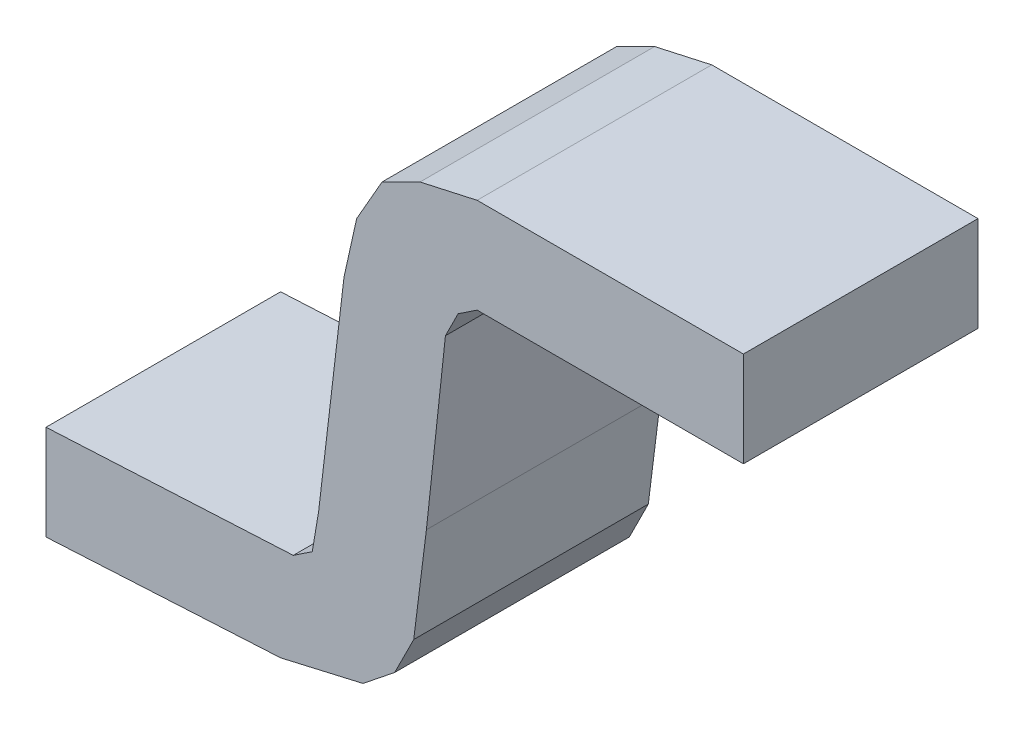
ISO-10303-21;
HEADER;
FILE_DESCRIPTION(('STEP AP214'),'2;1');
FILE_NAME('part.step','',(''),(''),'','','');
FILE_SCHEMA(('AUTOMOTIVE_DESIGN { 1 0 10303 214 1 1 1 1 }'));
ENDSEC;
DATA;
#1=APPLICATION_CONTEXT('core data for automotive mechanical design processes');
#2=APPLICATION_PROTOCOL_DEFINITION('international standard','automotive_design',2000,#1);
#3=PRODUCT_CONTEXT('',#1,'mechanical');
#4=PRODUCT('Part','Part','',(#3));
#5=PRODUCT_RELATED_PRODUCT_CATEGORY('part','',(#4));
#6=PRODUCT_DEFINITION_FORMATION('','',#4);
#7=PRODUCT_DEFINITION_CONTEXT('part definition',#1,'design');
#8=PRODUCT_DEFINITION('design','',#6,#7);
#9=PRODUCT_DEFINITION_SHAPE('','',#8);
#10=(LENGTH_UNIT() NAMED_UNIT(*) SI_UNIT(.MILLI.,.METRE.));
#11=(NAMED_UNIT(*) PLANE_ANGLE_UNIT() SI_UNIT($,.RADIAN.));
#12=(NAMED_UNIT(*) SI_UNIT($,.STERADIAN.) SOLID_ANGLE_UNIT());
#13=UNCERTAINTY_MEASURE_WITH_UNIT(LENGTH_MEASURE(1.E-05),#10,'distance_accuracy_value','');
#14=(GEOMETRIC_REPRESENTATION_CONTEXT(3) GLOBAL_UNCERTAINTY_ASSIGNED_CONTEXT((#13)) GLOBAL_UNIT_ASSIGNED_CONTEXT((#10,
#11,#12)) REPRESENTATION_CONTEXT('',''));
#15=CARTESIAN_POINT('',(0.,0.,0.));
#16=DIRECTION('',(0.,0.,1.));
#17=DIRECTION('',(1.,0.,0.));
#18=AXIS2_PLACEMENT_3D('',#15,#16,#17);
#19=CARTESIAN_POINT('',(-0.5499989,-0.3999992,0.));
#20=DIRECTION('',(0.,0.,-1.));
#21=DIRECTION('',(0.,-1.,0.));
#22=AXIS2_PLACEMENT_3D('',#19,#20,#21);
#23=PLANE('',#22);
#24=DIRECTION('',(-0.974391195694586,-0.224859506698904,0.));
#25=VECTOR('',#24,1.);
#26=CARTESIAN_POINT('',(-0.0499999,-0.3499993,0.));
#27=LINE('',#26,#25);
#28=CARTESIAN_POINT('',(-0.0499999,-0.3499993,0.));
#29=VERTEX_POINT('',#28);
#30=CARTESIAN_POINT('',(-0.17999964,-0.37999924,0.));
#31=VERTEX_POINT('',#30);
#32=EDGE_CURVE('E26',#29,#31,#27,.T.);
#33=ORIENTED_EDGE('',*,*,#32,.T.);
#34=DIRECTION('',(-0.99854227327751,-0.0539752580149735,0.));
#35=VECTOR('',#34,1.);
#36=CARTESIAN_POINT('',(-0.17999964,-0.37999924,0.));
#37=LINE('',#36,#35);
#38=CARTESIAN_POINT('',(-0.5499989,-0.3999992,0.));
#39=VERTEX_POINT('',#38);
#40=EDGE_CURVE('E11',#31,#39,#37,.T.);
#41=ORIENTED_EDGE('',*,*,#40,.T.);
#42=DIRECTION('',(0.,1.,0.));
#43=VECTOR('',#42,1.);
#44=CARTESIAN_POINT('',(-0.5499989,-0.3999992,0.));
#45=LINE('',#44,#43);
#46=CARTESIAN_POINT('',(-0.5499989,-0.2499995,0.));
#47=VERTEX_POINT('',#46);
#48=EDGE_CURVE('E343',#39,#47,#45,.T.);
#49=ORIENTED_EDGE('',*,*,#48,.T.);
#50=DIRECTION('',(0.99868766347659,0.051214751973139,0.));
#51=VECTOR('',#50,1.);
#52=CARTESIAN_POINT('',(-0.5499989,-0.2499995,0.));
#53=LINE('',#52,#51);
#54=CARTESIAN_POINT('',(-0.15999968,-0.22999954,0.));
#55=VERTEX_POINT('',#54);
#56=EDGE_CURVE('E351',#47,#55,#53,.T.);
#57=ORIENTED_EDGE('',*,*,#56,.T.);
#58=DIRECTION('',(0.832050294337998,0.554700196224998,0.));
#59=VECTOR('',#58,1.);
#60=CARTESIAN_POINT('',(-0.15999968,-0.22999954,0.));
#61=LINE('',#60,#59);
#62=CARTESIAN_POINT('',(-0.12999974,-0.20999958,0.));
#63=VERTEX_POINT('',#62);
#64=EDGE_CURVE('E371',#55,#63,#61,.T.);
#65=ORIENTED_EDGE('',*,*,#64,.T.);
#66=DIRECTION('',(0.164398987305033,0.986393923832198,0.));
#67=VECTOR('',#66,1.);
#68=CARTESIAN_POINT('',(-0.12999974,-0.20999958,0.));
#69=LINE('',#68,#67);
#70=CARTESIAN_POINT('',(-0.11999976,-0.1499997,0.));
#71=VERTEX_POINT('',#70);
#72=EDGE_CURVE('E309',#63,#71,#69,.T.);
#73=ORIENTED_EDGE('',*,*,#72,.T.);
#74=DIRECTION('',(0.116841247566991,0.993150604322924,0.));
#75=VECTOR('',#74,1.);
#76=CARTESIAN_POINT('',(-0.11999976,-0.1499997,0.));
#77=LINE('',#76,#75);
#78=CARTESIAN_POINT('',(-0.07999984,0.18999962,0.));
#79=VERTEX_POINT('',#78);
#80=EDGE_CURVE('E308',#71,#79,#77,.T.);
#81=ORIENTED_EDGE('',*,*,#80,.T.);
#82=DIRECTION('',(0.216924623806935,0.976188356612708,0.));
#83=VECTOR('',#82,1.);
#84=CARTESIAN_POINT('',(-0.07999984,0.18999962,0.));
#85=LINE('',#84,#83);
#86=CARTESIAN_POINT('',(-0.05999988,0.28000198,0.));
#87=VERTEX_POINT('',#86);
#88=EDGE_CURVE('E334',#79,#87,#85,.T.);
#89=ORIENTED_EDGE('',*,*,#88,.T.);
#90=DIRECTION('',(0.496138938357157,0.868243142124275,0.));
#91=VECTOR('',#90,1.);
#92=CARTESIAN_POINT('',(-0.05999987999999,0.28000198,0.));
#93=LINE('',#92,#91);
#94=CARTESIAN_POINT('',(-0.01999995999999,0.35000184,0.));
#95=VERTEX_POINT('',#94);
#96=EDGE_CURVE('E367',#87,#95,#93,.T.);
#97=ORIENTED_EDGE('',*,*,#96,.T.);
#98=DIRECTION('',(0.894427190999916,0.447213595499958,0.));
#99=VECTOR('',#98,1.);
#100=CARTESIAN_POINT('',(-0.01999995999999,0.35000184,0.));
#101=LINE('',#100,#99);
#102=CARTESIAN_POINT('',(0.03999992,0.38000178,0.));
#103=VERTEX_POINT('',#102);
#104=EDGE_CURVE('E366',#95,#103,#101,.T.);
#105=ORIENTED_EDGE('',*,*,#104,.T.);
#106=DIRECTION('',(0.976188356612708,0.216924623806935,0.));
#107=VECTOR('',#106,1.);
#108=CARTESIAN_POINT('',(0.03999992,0.38000178,0.));
#109=LINE('',#108,#107);
#110=CARTESIAN_POINT('',(0.13000228,0.40000174,0.));
#111=VERTEX_POINT('',#110);
#112=EDGE_CURVE('E273',#103,#111,#109,.T.);
#113=ORIENTED_EDGE('',*,*,#112,.T.);
#114=DIRECTION('',(1.,0.,0.));
#115=VECTOR('',#114,1.);
#116=CARTESIAN_POINT('',(-0.5499989,0.40000174,0.));
#117=LINE('',#116,#115);
#118=CARTESIAN_POINT('',(0.55000144,0.40000174,0.));
#119=VERTEX_POINT('',#118);
#120=EDGE_CURVE('E272',#111,#119,#117,.T.);
#121=ORIENTED_EDGE('',*,*,#120,.T.);
#122=DIRECTION('',(0.,-1.,0.));
#123=VECTOR('',#122,1.);
#124=CARTESIAN_POINT('',(0.55000144,-0.3999992,0.));
#125=LINE('',#124,#123);
#126=CARTESIAN_POINT('',(0.55000144,0.25000204,0.));
#127=VERTEX_POINT('',#126);
#128=EDGE_CURVE('E317',#119,#127,#125,.T.);
#129=ORIENTED_EDGE('',*,*,#128,.T.);
#130=DIRECTION('',(-1.,0.,0.));
#131=VECTOR('',#130,1.);
#132=CARTESIAN_POINT('',(-0.5499989,0.25000204,0.));
#133=LINE('',#132,#131);
#134=CARTESIAN_POINT('',(0.13000228,0.25000204,0.));
#135=VERTEX_POINT('',#134);
#136=EDGE_CURVE('E413',#127,#135,#133,.T.);
#137=ORIENTED_EDGE('',*,*,#136,.T.);
#138=DIRECTION('',(-0.832017780148893,-0.554748964411929,0.));
#139=VECTOR('',#138,1.);
#140=CARTESIAN_POINT('',(0.13000228,0.25000204,0.));
#141=LINE('',#140,#139);
#142=CARTESIAN_POINT('',(0.10000234,0.22999954,0.));
#143=VERTEX_POINT('',#142);
#144=EDGE_CURVE('E361',#135,#143,#141,.T.);
#145=ORIENTED_EDGE('',*,*,#144,.T.);
#146=DIRECTION('',(-0.447259030760936,-0.894404471926873,0.));
#147=VECTOR('',#146,1.);
#148=CARTESIAN_POINT('',(0.10000234,0.22999954,0.));
#149=LINE('',#148,#147);
#150=CARTESIAN_POINT('',(0.07999983999998,0.18999962,0.));
#151=VERTEX_POINT('',#150);
#152=EDGE_CURVE('E360',#143,#151,#149,.T.);
#153=ORIENTED_EDGE('',*,*,#152,.T.);
#154=DIRECTION('',(-0.106533123633983,-0.994309153919839,0.));
#155=VECTOR('',#154,1.);
#156=CARTESIAN_POINT('',(0.07999984,0.18999962,0.));
#157=LINE('',#156,#155);
#158=CARTESIAN_POINT('',(0.0499999,-0.08999981999991,0.));
#159=VERTEX_POINT('',#158);
#160=EDGE_CURVE('E258',#151,#159,#157,.T.);
#161=ORIENTED_EDGE('',*,*,#160,.T.);
#162=DIRECTION('',(-0.124034734588962,-0.992277876713698,0.));
#163=VECTOR('',#162,1.);
#164=CARTESIAN_POINT('',(0.0499999,-0.08999982,0.));
#165=LINE('',#164,#163);
#166=CARTESIAN_POINT('',(0.02999994,-0.2499995,0.));
#167=VERTEX_POINT('',#166);
#168=EDGE_CURVE('E285',#159,#167,#165,.T.);
#169=ORIENTED_EDGE('',*,*,#168,.T.);
#170=DIRECTION('',(-0.447213595499958,-0.894427190999916,0.));
#171=VECTOR('',#170,1.);
#172=CARTESIAN_POINT('',(0.02999994,-0.2499995,0.));
#173=LINE('',#172,#171);
#174=CARTESIAN_POINT('',(0.,-0.30999938,0.));
#175=VERTEX_POINT('',#174);
#176=EDGE_CURVE('E238',#167,#175,#173,.T.);
#177=ORIENTED_EDGE('',*,*,#176,.T.);
#178=DIRECTION('',(-0.780868809443226,-0.62469504755418,0.));
#179=VECTOR('',#178,1.);
#180=CARTESIAN_POINT('',(0.,-0.30999938,0.));
#181=LINE('',#180,#179);
#182=EDGE_CURVE('E203',#175,#29,#181,.T.);
#183=ORIENTED_EDGE('',*,*,#182,.T.);
#184=EDGE_LOOP('',(#33,#41,#49,#57,#65,#73,#81,#89,#97,#105,#113,#121,#129,#137,#145,#153,#161,
#169,#177,#183));
#185=FACE_BOUND('',#184,.T.);
#186=ADVANCED_FACE('F17',(#185),#23,.T.);
#187=CARTESIAN_POINT('',(-0.5499989,-0.3999992,0.));
#188=DIRECTION('',(-0.0539752580149037,0.998542273277514,0.));
#189=DIRECTION('',(0.,0.,1.));
#190=AXIS2_PLACEMENT_3D('',#187,#188,#189);
#191=PLANE('',#190);
#192=DIRECTION('',(0.,0.,-1.));
#193=VECTOR('',#192,1.);
#194=CARTESIAN_POINT('',(-0.17999964,-0.37999924,0.));
#195=LINE('',#194,#193);
#196=CARTESIAN_POINT('',(-0.17999964,-0.37999924,0.37));
#197=VERTEX_POINT('',#196);
#198=EDGE_CURVE('E20',#197,#31,#195,.T.);
#199=ORIENTED_EDGE('',*,*,#198,.F.);
#200=DIRECTION('',(0.998542273277514,0.0539752580149037,0.));
#201=VECTOR('',#200,1.);
#202=CARTESIAN_POINT('',(-0.5499989,-0.3999992,0.37));
#203=LINE('',#202,#201);
#204=CARTESIAN_POINT('',(-0.5499989,-0.3999992,0.37));
#205=VERTEX_POINT('',#204);
#206=EDGE_CURVE('E199',#205,#197,#203,.T.);
#207=ORIENTED_EDGE('',*,*,#206,.F.);
#208=DIRECTION('',(0.,0.,1.));
#209=VECTOR('',#208,1.);
#210=CARTESIAN_POINT('',(-0.5499989,-0.3999992,0.));
#211=LINE('',#210,#209);
#212=EDGE_CURVE('E213',#39,#205,#211,.T.);
#213=ORIENTED_EDGE('',*,*,#212,.F.);
#214=ORIENTED_EDGE('',*,*,#40,.F.);
#215=EDGE_LOOP('',(#199,#207,#213,#214));
#216=FACE_BOUND('',#215,.T.);
#217=ADVANCED_FACE('F198',(#216),#191,.F.);
#218=CARTESIAN_POINT('',(-0.17999964,-0.37999924,0.));
#219=DIRECTION('',(-0.224859506698904,0.974391195694586,0.));
#220=DIRECTION('',(0.,0.,1.));
#221=AXIS2_PLACEMENT_3D('',#218,#219,#220);
#222=PLANE('',#221);
#223=DIRECTION('',(0.,0.,-1.));
#224=VECTOR('',#223,1.);
#225=CARTESIAN_POINT('',(-0.0499999,-0.3499993,0.));
#226=LINE('',#225,#224);
#227=CARTESIAN_POINT('',(-0.0499999,-0.3499993,0.37));
#228=VERTEX_POINT('',#227);
#229=EDGE_CURVE('E217',#228,#29,#226,.T.);
#230=ORIENTED_EDGE('',*,*,#229,.F.);
#231=DIRECTION('',(0.974391195694586,0.224859506698904,0.));
#232=VECTOR('',#231,1.);
#233=CARTESIAN_POINT('',(-0.17999964,-0.37999924,0.37));
#234=LINE('',#233,#232);
#235=EDGE_CURVE('E208',#197,#228,#234,.T.);
#236=ORIENTED_EDGE('',*,*,#235,.F.);
#237=ORIENTED_EDGE('',*,*,#198,.T.);
#238=ORIENTED_EDGE('',*,*,#32,.F.);
#239=EDGE_LOOP('',(#230,#236,#237,#238));
#240=FACE_BOUND('',#239,.T.);
#241=ADVANCED_FACE('F215',(#240),#222,.F.);
#242=CARTESIAN_POINT('',(-0.0499999,-0.3499993,0.));
#243=DIRECTION('',(-0.62469504755418,0.780868809443226,0.));
#244=DIRECTION('',(0.,0.,1.));
#245=AXIS2_PLACEMENT_3D('',#242,#243,#244);
#246=PLANE('',#245);
#247=DIRECTION('',(0.,0.,-1.));
#248=VECTOR('',#247,1.);
#249=CARTESIAN_POINT('',(0.,-0.30999938,0.));
#250=LINE('',#249,#248);
#251=CARTESIAN_POINT('',(0.,-0.30999938,0.37));
#252=VERTEX_POINT('',#251);
#253=EDGE_CURVE('E242',#252,#175,#250,.T.);
#254=ORIENTED_EDGE('',*,*,#253,.F.);
#255=DIRECTION('',(0.780868809443226,0.62469504755418,0.));
#256=VECTOR('',#255,1.);
#257=CARTESIAN_POINT('',(-0.0499999,-0.3499993,0.37));
#258=LINE('',#257,#256);
#259=EDGE_CURVE('E220',#228,#252,#258,.T.);
#260=ORIENTED_EDGE('',*,*,#259,.F.);
#261=ORIENTED_EDGE('',*,*,#229,.T.);
#262=ORIENTED_EDGE('',*,*,#182,.F.);
#263=EDGE_LOOP('',(#254,#260,#261,#262));
#264=FACE_BOUND('',#263,.T.);
#265=ADVANCED_FACE('F435',(#264),#246,.F.);
#266=CARTESIAN_POINT('',(0.,-0.30999938,0.));
#267=DIRECTION('',(-0.894427190999916,0.447213595499958,0.));
#268=DIRECTION('',(0.,0.,1.));
#269=AXIS2_PLACEMENT_3D('',#266,#267,#268);
#270=PLANE('',#269);
#271=DIRECTION('',(0.,0.,-1.));
#272=VECTOR('',#271,1.);
#273=CARTESIAN_POINT('',(0.02999994,-0.2499995,0.));
#274=LINE('',#273,#272);
#275=CARTESIAN_POINT('',(0.02999994,-0.2499995,0.37));
#276=VERTEX_POINT('',#275);
#277=EDGE_CURVE('E262',#276,#167,#274,.T.);
#278=ORIENTED_EDGE('',*,*,#277,.F.);
#279=DIRECTION('',(0.447213595499958,0.894427190999916,0.));
#280=VECTOR('',#279,1.);
#281=CARTESIAN_POINT('',(0.,-0.30999938,0.37));
#282=LINE('',#281,#280);
#283=EDGE_CURVE('E226',#252,#276,#282,.T.);
#284=ORIENTED_EDGE('',*,*,#283,.F.);
#285=ORIENTED_EDGE('',*,*,#253,.T.);
#286=ORIENTED_EDGE('',*,*,#176,.F.);
#287=EDGE_LOOP('',(#278,#284,#285,#286));
#288=FACE_BOUND('',#287,.T.);
#289=ADVANCED_FACE('F439',(#288),#270,.F.);
#290=CARTESIAN_POINT('',(0.02999994,-0.2499995,0.));
#291=DIRECTION('',(-0.992277876713698,0.124034734588962,0.));
#292=DIRECTION('',(0.,0.,1.));
#293=AXIS2_PLACEMENT_3D('',#290,#291,#292);
#294=PLANE('',#293);
#295=DIRECTION('',(0.,0.,-1.));
#296=VECTOR('',#295,1.);
#297=CARTESIAN_POINT('',(0.04999989999996,-0.08999982,0.));
#298=LINE('',#297,#296);
#299=CARTESIAN_POINT('',(0.04999990000001,-0.08999981999981,0.37));
#300=VERTEX_POINT('',#299);
#301=EDGE_CURVE('E263',#300,#159,#298,.T.);
#302=ORIENTED_EDGE('',*,*,#301,.F.);
#303=DIRECTION('',(0.124034734588962,0.992277876713698,0.));
#304=VECTOR('',#303,1.);
#305=CARTESIAN_POINT('',(0.02999994,-0.2499995,0.37));
#306=LINE('',#305,#304);
#307=EDGE_CURVE('E246',#276,#300,#306,.T.);
#308=ORIENTED_EDGE('',*,*,#307,.F.);
#309=ORIENTED_EDGE('',*,*,#277,.T.);
#310=ORIENTED_EDGE('',*,*,#168,.F.);
#311=EDGE_LOOP('',(#302,#308,#309,#310));
#312=FACE_BOUND('',#311,.T.);
#313=ADVANCED_FACE('F441',(#312),#294,.F.);
#314=CARTESIAN_POINT('',(0.0499999,-0.08999982,0.));
#315=DIRECTION('',(-0.994309153919839,0.106533123633983,0.));
#316=DIRECTION('',(0.,0.,1.));
#317=AXIS2_PLACEMENT_3D('',#314,#315,#316);
#318=PLANE('',#317);
#319=DIRECTION('',(0.,0.,-1.));
#320=VECTOR('',#319,1.);
#321=CARTESIAN_POINT('',(0.07999983999992,0.18999962,0.));
#322=LINE('',#321,#320);
#323=CARTESIAN_POINT('',(0.07999983999998,0.18999962,0.37));
#324=VERTEX_POINT('',#323);
#325=EDGE_CURVE('E356',#324,#151,#322,.T.);
#326=ORIENTED_EDGE('',*,*,#325,.F.);
#327=DIRECTION('',(0.106533123633983,0.994309153919839,0.));
#328=VECTOR('',#327,1.);
#329=CARTESIAN_POINT('',(0.0499999,-0.08999982,0.37));
#330=LINE('',#329,#328);
#331=EDGE_CURVE('E250',#300,#324,#330,.T.);
#332=ORIENTED_EDGE('',*,*,#331,.F.);
#333=ORIENTED_EDGE('',*,*,#301,.T.);
#334=ORIENTED_EDGE('',*,*,#160,.F.);
#335=EDGE_LOOP('',(#326,#332,#333,#334));
#336=FACE_BOUND('',#335,.T.);
#337=ADVANCED_FACE('F444',(#336),#318,.F.);
#338=CARTESIAN_POINT('',(0.07999984,0.18999962,0.));
#339=DIRECTION('',(-0.894404471926873,0.447259030760936,0.));
#340=DIRECTION('',(0.,0.,1.));
#341=AXIS2_PLACEMENT_3D('',#338,#339,#340);
#342=PLANE('',#341);
#343=DIRECTION('',(0.,0.,-1.));
#344=VECTOR('',#343,1.);
#345=CARTESIAN_POINT('',(0.10000234,0.22999954,0.));
#346=LINE('',#345,#344);
#347=CARTESIAN_POINT('',(0.10000234,0.22999954,0.37));
#348=VERTEX_POINT('',#347);
#349=EDGE_CURVE('E405',#348,#143,#346,.T.);
#350=ORIENTED_EDGE('',*,*,#349,.F.);
#351=DIRECTION('',(0.447259030760936,0.894404471926873,0.));
#352=VECTOR('',#351,1.);
#353=CARTESIAN_POINT('',(0.07999984,0.18999962,0.37));
#354=LINE('',#353,#352);
#355=EDGE_CURVE('E267',#324,#348,#354,.T.);
#356=ORIENTED_EDGE('',*,*,#355,.F.);
#357=ORIENTED_EDGE('',*,*,#325,.T.);
#358=ORIENTED_EDGE('',*,*,#152,.F.);
#359=EDGE_LOOP('',(#350,#356,#357,#358));
#360=FACE_BOUND('',#359,.T.);
#361=ADVANCED_FACE('F448',(#360),#342,.F.);
#362=CARTESIAN_POINT('',(0.10000234,0.22999954,0.));
#363=DIRECTION('',(-0.554748964411929,0.832017780148894,0.));
#364=DIRECTION('',(0.,0.,1.));
#365=AXIS2_PLACEMENT_3D('',#362,#363,#364);
#366=PLANE('',#365);
#367=DIRECTION('',(0.,0.,-1.));
#368=VECTOR('',#367,1.);
#369=CARTESIAN_POINT('',(0.13000228,0.25000204,0.));
#370=LINE('',#369,#368);
#371=CARTESIAN_POINT('',(0.13000228,0.25000204,0.37));
#372=VERTEX_POINT('',#371);
#373=EDGE_CURVE('E409',#372,#135,#370,.T.);
#374=ORIENTED_EDGE('',*,*,#373,.F.);
#375=DIRECTION('',(0.832017780148893,0.554748964411929,0.));
#376=VECTOR('',#375,1.);
#377=CARTESIAN_POINT('',(0.10000234,0.22999954,0.37));
#378=LINE('',#377,#376);
#379=EDGE_CURVE('E274',#348,#372,#378,.T.);
#380=ORIENTED_EDGE('',*,*,#379,.F.);
#381=ORIENTED_EDGE('',*,*,#349,.T.);
#382=ORIENTED_EDGE('',*,*,#144,.F.);
#383=EDGE_LOOP('',(#374,#380,#381,#382));
#384=FACE_BOUND('',#383,.T.);
#385=ADVANCED_FACE('F450',(#384),#366,.F.);
#386=CARTESIAN_POINT('',(0.13000228,0.25000204,0.));
#387=DIRECTION('',(0.,1.,0.));
#388=DIRECTION('',(1.,0.,0.));
#389=AXIS2_PLACEMENT_3D('',#386,#387,#388);
#390=PLANE('',#389);
#391=DIRECTION('',(0.,0.,-1.));
#392=VECTOR('',#391,1.);
#393=CARTESIAN_POINT('',(0.55000144,0.25000204,0.));
#394=LINE('',#393,#392);
#395=CARTESIAN_POINT('',(0.55000144,0.25000204,0.37));
#396=VERTEX_POINT('',#395);
#397=EDGE_CURVE('E313',#396,#127,#394,.T.);
#398=ORIENTED_EDGE('',*,*,#397,.F.);
#399=DIRECTION('',(1.,0.,0.));
#400=VECTOR('',#399,1.);
#401=CARTESIAN_POINT('',(0.13000228,0.25000204,0.37));
#402=LINE('',#401,#400);
#403=EDGE_CURVE('E278',#372,#396,#402,.T.);
#404=ORIENTED_EDGE('',*,*,#403,.F.);
#405=ORIENTED_EDGE('',*,*,#373,.T.);
#406=ORIENTED_EDGE('',*,*,#136,.F.);
#407=EDGE_LOOP('',(#398,#404,#405,#406));
#408=FACE_BOUND('',#407,.T.);
#409=ADVANCED_FACE('F453',(#408),#390,.F.);
#410=CARTESIAN_POINT('',(0.55000144,0.25000204,0.));
#411=DIRECTION('',(-1.,0.,0.));
#412=DIRECTION('',(0.,0.,1.));
#413=AXIS2_PLACEMENT_3D('',#410,#411,#412);
#414=PLANE('',#413);
#415=DIRECTION('',(0.,0.,-1.));
#416=VECTOR('',#415,1.);
#417=CARTESIAN_POINT('',(0.55000144,0.40000174,0.));
#418=LINE('',#417,#416);
#419=CARTESIAN_POINT('',(0.55000144,0.40000174,0.37));
#420=VERTEX_POINT('',#419);
#421=EDGE_CURVE('E268',#420,#119,#418,.T.);
#422=ORIENTED_EDGE('',*,*,#421,.F.);
#423=DIRECTION('',(0.,1.,0.));
#424=VECTOR('',#423,1.);
#425=CARTESIAN_POINT('',(0.55000144,0.25000204,0.37));
#426=LINE('',#425,#424);
#427=EDGE_CURVE('E289',#396,#420,#426,.T.);
#428=ORIENTED_EDGE('',*,*,#427,.F.);
#429=ORIENTED_EDGE('',*,*,#397,.T.);
#430=ORIENTED_EDGE('',*,*,#128,.F.);
#431=EDGE_LOOP('',(#422,#428,#429,#430));
#432=FACE_BOUND('',#431,.T.);
#433=ADVANCED_FACE('F457',(#432),#414,.F.);
#434=CARTESIAN_POINT('',(0.55000144,0.40000174,0.));
#435=DIRECTION('',(0.,-1.,0.));
#436=DIRECTION('',(0.,0.,-1.));
#437=AXIS2_PLACEMENT_3D('',#434,#435,#436);
#438=PLANE('',#437);
#439=DIRECTION('',(0.,0.,-1.));
#440=VECTOR('',#439,1.);
#441=CARTESIAN_POINT('',(0.13000228,0.40000174,0.));
#442=LINE('',#441,#440);
#443=CARTESIAN_POINT('',(0.13000228,0.40000174,0.37));
#444=VERTEX_POINT('',#443);
#445=EDGE_CURVE('E392',#444,#111,#442,.T.);
#446=ORIENTED_EDGE('',*,*,#445,.F.);
#447=DIRECTION('',(-1.,0.,0.));
#448=VECTOR('',#447,1.);
#449=CARTESIAN_POINT('',(0.55000144,0.40000174,0.37));
#450=LINE('',#449,#448);
#451=EDGE_CURVE('E300',#420,#444,#450,.T.);
#452=ORIENTED_EDGE('',*,*,#451,.F.);
#453=ORIENTED_EDGE('',*,*,#421,.T.);
#454=ORIENTED_EDGE('',*,*,#120,.F.);
#455=EDGE_LOOP('',(#446,#452,#453,#454));
#456=FACE_BOUND('',#455,.T.);
#457=ADVANCED_FACE('F459',(#456),#438,.F.);
#458=CARTESIAN_POINT('',(0.13000228,0.40000174,0.));
#459=DIRECTION('',(0.216924623806935,-0.976188356612708,0.));
#460=DIRECTION('',(0.,0.,-1.));
#461=AXIS2_PLACEMENT_3D('',#458,#459,#460);
#462=PLANE('',#461);
#463=DIRECTION('',(0.,0.,-1.));
#464=VECTOR('',#463,1.);
#465=CARTESIAN_POINT('',(0.03999992,0.38000178,0.));
#466=LINE('',#465,#464);
#467=CARTESIAN_POINT('',(0.03999992,0.38000178,0.37));
#468=VERTEX_POINT('',#467);
#469=EDGE_CURVE('E362',#468,#103,#466,.T.);
#470=ORIENTED_EDGE('',*,*,#469,.F.);
#471=DIRECTION('',(-0.976188356612708,-0.216924623806935,0.));
#472=VECTOR('',#471,1.);
#473=CARTESIAN_POINT('',(0.13000228,0.40000174,0.37));
#474=LINE('',#473,#472);
#475=EDGE_CURVE('E296',#444,#468,#474,.T.);
#476=ORIENTED_EDGE('',*,*,#475,.F.);
#477=ORIENTED_EDGE('',*,*,#445,.T.);
#478=ORIENTED_EDGE('',*,*,#112,.F.);
#479=EDGE_LOOP('',(#470,#476,#477,#478));
#480=FACE_BOUND('',#479,.T.);
#481=ADVANCED_FACE('F462',(#480),#462,.F.);
#482=CARTESIAN_POINT('',(0.03999992,0.38000178,0.));
#483=DIRECTION('',(0.447213595499958,-0.894427190999916,0.));
#484=DIRECTION('',(0.,0.,-1.));
#485=AXIS2_PLACEMENT_3D('',#482,#483,#484);
#486=PLANE('',#485);
#487=DIRECTION('',(0.,0.,-1.));
#488=VECTOR('',#487,1.);
#489=CARTESIAN_POINT('',(-0.01999995999999,0.35000184,0.));
#490=LINE('',#489,#488);
#491=CARTESIAN_POINT('',(-0.01999995999999,0.35000184,0.37));
#492=VERTEX_POINT('',#491);
#493=EDGE_CURVE('E382',#492,#95,#490,.T.);
#494=ORIENTED_EDGE('',*,*,#493,.F.);
#495=DIRECTION('',(-0.894427190999916,-0.447213595499958,0.));
#496=VECTOR('',#495,1.);
#497=CARTESIAN_POINT('',(0.03999992,0.38000178,0.37));
#498=LINE('',#497,#496);
#499=EDGE_CURVE('E237',#468,#492,#498,.T.);
#500=ORIENTED_EDGE('',*,*,#499,.F.);
#501=ORIENTED_EDGE('',*,*,#469,.T.);
#502=ORIENTED_EDGE('',*,*,#104,.F.);
#503=EDGE_LOOP('',(#494,#500,#501,#502));
#504=FACE_BOUND('',#503,.T.);
#505=ADVANCED_FACE('F466',(#504),#486,.F.);
#506=CARTESIAN_POINT('',(-0.01999995999999,0.35000184,0.));
#507=DIRECTION('',(0.868243142124275,-0.496138938357157,0.));
#508=DIRECTION('',(0.,0.,-1.));
#509=AXIS2_PLACEMENT_3D('',#506,#507,#508);
#510=PLANE('',#509);
#511=DIRECTION('',(0.,0.,-1.));
#512=VECTOR('',#511,1.);
#513=CARTESIAN_POINT('',(-0.05999988000002,0.28000198,0.));
#514=LINE('',#513,#512);
#515=CARTESIAN_POINT('',(-0.05999988,0.28000198,0.37));
#516=VERTEX_POINT('',#515);
#517=EDGE_CURVE('E330',#516,#87,#514,.T.);
#518=ORIENTED_EDGE('',*,*,#517,.F.);
#519=DIRECTION('',(-0.496138938357157,-0.868243142124275,0.));
#520=VECTOR('',#519,1.);
#521=CARTESIAN_POINT('',(-0.01999995999999,0.35000184,0.37));
#522=LINE('',#521,#520);
#523=EDGE_CURVE('E232',#492,#516,#522,.T.);
#524=ORIENTED_EDGE('',*,*,#523,.F.);
#525=ORIENTED_EDGE('',*,*,#493,.T.);
#526=ORIENTED_EDGE('',*,*,#96,.F.);
#527=EDGE_LOOP('',(#518,#524,#525,#526));
#528=FACE_BOUND('',#527,.T.);
#529=ADVANCED_FACE('F468',(#528),#510,.F.);
#530=CARTESIAN_POINT('',(-0.05999987999999,0.28000198,0.));
#531=DIRECTION('',(0.976188356612708,-0.216924623806935,0.));
#532=DIRECTION('',(0.,0.,-1.));
#533=AXIS2_PLACEMENT_3D('',#530,#531,#532);
#534=PLANE('',#533);
#535=DIRECTION('',(0.,0.,-1.));
#536=VECTOR('',#535,1.);
#537=CARTESIAN_POINT('',(-0.07999984000001,0.18999962,0.));
#538=LINE('',#537,#536);
#539=CARTESIAN_POINT('',(-0.07999984,0.18999962,0.37));
#540=VERTEX_POINT('',#539);
#541=EDGE_CURVE('E304',#540,#79,#538,.T.);
#542=ORIENTED_EDGE('',*,*,#541,.F.);
#543=DIRECTION('',(-0.216924623806935,-0.976188356612708,0.));
#544=VECTOR('',#543,1.);
#545=CARTESIAN_POINT('',(-0.05999987999999,0.28000198,0.37));
#546=LINE('',#545,#544);
#547=EDGE_CURVE('E236',#516,#540,#546,.T.);
#548=ORIENTED_EDGE('',*,*,#547,.F.);
#549=ORIENTED_EDGE('',*,*,#517,.T.);
#550=ORIENTED_EDGE('',*,*,#88,.F.);
#551=EDGE_LOOP('',(#542,#548,#549,#550));
#552=FACE_BOUND('',#551,.T.);
#553=ADVANCED_FACE('F471',(#552),#534,.F.);
#554=CARTESIAN_POINT('',(-0.07999984,0.18999962,0.));
#555=DIRECTION('',(0.993150604322924,-0.116841247566991,0.));
#556=DIRECTION('',(0.,0.,-1.));
#557=AXIS2_PLACEMENT_3D('',#554,#555,#556);
#558=PLANE('',#557);
#559=DIRECTION('',(0.,0.,-1.));
#560=VECTOR('',#559,1.);
#561=CARTESIAN_POINT('',(-0.11999976,-0.1499997,0.));
#562=LINE('',#561,#560);
#563=CARTESIAN_POINT('',(-0.11999976,-0.1499997,0.37));
#564=VERTEX_POINT('',#563);
#565=EDGE_CURVE('E372',#564,#71,#562,.T.);
#566=ORIENTED_EDGE('',*,*,#565,.F.);
#567=DIRECTION('',(-0.116841247566991,-0.993150604322924,0.));
#568=VECTOR('',#567,1.);
#569=CARTESIAN_POINT('',(-0.07999984,0.18999962,0.37));
#570=LINE('',#569,#568);
#571=EDGE_CURVE('E229',#540,#564,#570,.T.);
#572=ORIENTED_EDGE('',*,*,#571,.F.);
#573=ORIENTED_EDGE('',*,*,#541,.T.);
#574=ORIENTED_EDGE('',*,*,#80,.F.);
#575=EDGE_LOOP('',(#566,#572,#573,#574));
#576=FACE_BOUND('',#575,.T.);
#577=ADVANCED_FACE('F665',(#576),#558,.F.);
#578=CARTESIAN_POINT('',(-0.11999976,-0.1499997,0.));
#579=DIRECTION('',(0.986393923832198,-0.164398987305033,0.));
#580=DIRECTION('',(0.,0.,-1.));
#581=AXIS2_PLACEMENT_3D('',#578,#579,#580);
#582=PLANE('',#581);
#583=DIRECTION('',(0.,0.,-1.));
#584=VECTOR('',#583,1.);
#585=CARTESIAN_POINT('',(-0.12999974,-0.20999958,0.));
#586=LINE('',#585,#584);
#587=CARTESIAN_POINT('',(-0.12999974,-0.20999958,0.37));
#588=VERTEX_POINT('',#587);
#589=EDGE_CURVE('E355',#588,#63,#586,.T.);
#590=ORIENTED_EDGE('',*,*,#589,.F.);
#591=DIRECTION('',(-0.164398987305033,-0.986393923832198,0.));
#592=VECTOR('',#591,1.);
#593=CARTESIAN_POINT('',(-0.11999976,-0.1499997,0.37));
#594=LINE('',#593,#592);
#595=EDGE_CURVE('E251',#564,#588,#594,.T.);
#596=ORIENTED_EDGE('',*,*,#595,.F.);
#597=ORIENTED_EDGE('',*,*,#565,.T.);
#598=ORIENTED_EDGE('',*,*,#72,.F.);
#599=EDGE_LOOP('',(#590,#596,#597,#598));
#600=FACE_BOUND('',#599,.T.);
#601=ADVANCED_FACE('F705',(#600),#582,.F.);
#602=CARTESIAN_POINT('',(-0.12999974,-0.20999958,0.));
#603=DIRECTION('',(0.554700196224998,-0.832050294337998,0.));
#604=DIRECTION('',(0.,0.,-1.));
#605=AXIS2_PLACEMENT_3D('',#602,#603,#604);
#606=PLANE('',#605);
#607=DIRECTION('',(0.,0.,-1.));
#608=VECTOR('',#607,1.);
#609=CARTESIAN_POINT('',(-0.15999968,-0.22999954,0.));
#610=LINE('',#609,#608);
#611=CARTESIAN_POINT('',(-0.15999968,-0.22999954,0.37));
#612=VERTEX_POINT('',#611);
#613=EDGE_CURVE('E347',#612,#55,#610,.T.);
#614=ORIENTED_EDGE('',*,*,#613,.F.);
#615=DIRECTION('',(-0.832050294337998,-0.554700196224998,0.));
#616=VECTOR('',#615,1.);
#617=CARTESIAN_POINT('',(-0.12999974,-0.20999958,0.37));
#618=LINE('',#617,#616);
#619=EDGE_CURVE('E255',#588,#612,#618,.T.);
#620=ORIENTED_EDGE('',*,*,#619,.F.);
#621=ORIENTED_EDGE('',*,*,#589,.T.);
#622=ORIENTED_EDGE('',*,*,#64,.F.);
#623=EDGE_LOOP('',(#614,#620,#621,#622));
#624=FACE_BOUND('',#623,.T.);
#625=ADVANCED_FACE('F688',(#624),#606,.F.);
#626=CARTESIAN_POINT('',(-0.15999968,-0.22999954,0.));
#627=DIRECTION('',(0.0512147519730592,-0.998687663476594,0.));
#628=DIRECTION('',(0.,0.,-1.));
#629=AXIS2_PLACEMENT_3D('',#626,#627,#628);
#630=PLANE('',#629);
#631=DIRECTION('',(0.,0.,-1.));
#632=VECTOR('',#631,1.);
#633=CARTESIAN_POINT('',(-0.5499989,-0.2499995,0.));
#634=LINE('',#633,#632);
#635=CARTESIAN_POINT('',(-0.5499989,-0.2499995,0.37));
#636=VERTEX_POINT('',#635);
#637=EDGE_CURVE('E295',#636,#47,#634,.T.);
#638=ORIENTED_EDGE('',*,*,#637,.F.);
#639=DIRECTION('',(-0.998687663476594,-0.0512147519730592,0.));
#640=VECTOR('',#639,1.);
#641=CARTESIAN_POINT('',(-0.15999968,-0.22999954,0.37));
#642=LINE('',#641,#640);
#643=EDGE_CURVE('E324',#612,#636,#642,.T.);
#644=ORIENTED_EDGE('',*,*,#643,.F.);
#645=ORIENTED_EDGE('',*,*,#613,.T.);
#646=ORIENTED_EDGE('',*,*,#56,.F.);
#647=EDGE_LOOP('',(#638,#644,#645,#646));
#648=FACE_BOUND('',#647,.T.);
#649=ADVANCED_FACE('F679',(#648),#630,.F.);
#650=CARTESIAN_POINT('',(-0.5499989,-0.2499995,0.));
#651=DIRECTION('',(1.,0.,0.));
#652=DIRECTION('',(0.,1.,0.));
#653=AXIS2_PLACEMENT_3D('',#650,#651,#652);
#654=PLANE('',#653);
#655=ORIENTED_EDGE('',*,*,#212,.T.);
#656=DIRECTION('',(0.,-1.,0.));
#657=VECTOR('',#656,1.);
#658=CARTESIAN_POINT('',(-0.5499989,-0.2499995,0.37));
#659=LINE('',#658,#657);
#660=EDGE_CURVE('E211',#636,#205,#659,.T.);
#661=ORIENTED_EDGE('',*,*,#660,.F.);
#662=ORIENTED_EDGE('',*,*,#637,.T.);
#663=ORIENTED_EDGE('',*,*,#48,.F.);
#664=EDGE_LOOP('',(#655,#661,#662,#663));
#665=FACE_BOUND('',#664,.T.);
#666=ADVANCED_FACE('F674',(#665),#654,.F.);
#667=CARTESIAN_POINT('',(-0.5499989,-0.3999992,0.37));
#668=DIRECTION('',(0.,0.,-1.));
#669=DIRECTION('',(0.,-1.,0.));
#670=AXIS2_PLACEMENT_3D('',#667,#668,#669);
#671=PLANE('',#670);
#672=ORIENTED_EDGE('',*,*,#235,.T.);
#673=ORIENTED_EDGE('',*,*,#259,.T.);
#674=ORIENTED_EDGE('',*,*,#283,.T.);
#675=ORIENTED_EDGE('',*,*,#307,.T.);
#676=ORIENTED_EDGE('',*,*,#331,.T.);
#677=ORIENTED_EDGE('',*,*,#355,.T.);
#678=ORIENTED_EDGE('',*,*,#379,.T.);
#679=ORIENTED_EDGE('',*,*,#403,.T.);
#680=ORIENTED_EDGE('',*,*,#427,.T.);
#681=ORIENTED_EDGE('',*,*,#451,.T.);
#682=ORIENTED_EDGE('',*,*,#475,.T.);
#683=ORIENTED_EDGE('',*,*,#499,.T.);
#684=ORIENTED_EDGE('',*,*,#523,.T.);
#685=ORIENTED_EDGE('',*,*,#547,.T.);
#686=ORIENTED_EDGE('',*,*,#571,.T.);
#687=ORIENTED_EDGE('',*,*,#595,.T.);
#688=ORIENTED_EDGE('',*,*,#619,.T.);
#689=ORIENTED_EDGE('',*,*,#643,.T.);
#690=ORIENTED_EDGE('',*,*,#660,.T.);
#691=ORIENTED_EDGE('',*,*,#206,.T.);
#692=EDGE_LOOP('',(#672,#673,#674,#675,#676,#677,#678,#679,#680,#681,#682,#683,#684,#685,#686,
#687,#688,#689,#690,#691));
#693=FACE_BOUND('',#692,.T.);
#694=ADVANCED_FACE('F206',(#693),#671,.F.);
#695=CLOSED_SHELL('',(#186,#217,#241,#265,#289,#313,#337,#361,#385,#409,#433,#457,#481,#505,
#529,#553,#577,#601,#625,#649,#666,#694));
#696=MANIFOLD_SOLID_BREP('B1',#695);
#697=ADVANCED_BREP_SHAPE_REPRESENTATION('',(#18,#696),#14);
#698=SHAPE_DEFINITION_REPRESENTATION(#9,#697);
ENDSEC;
END-ISO-10303-21;
